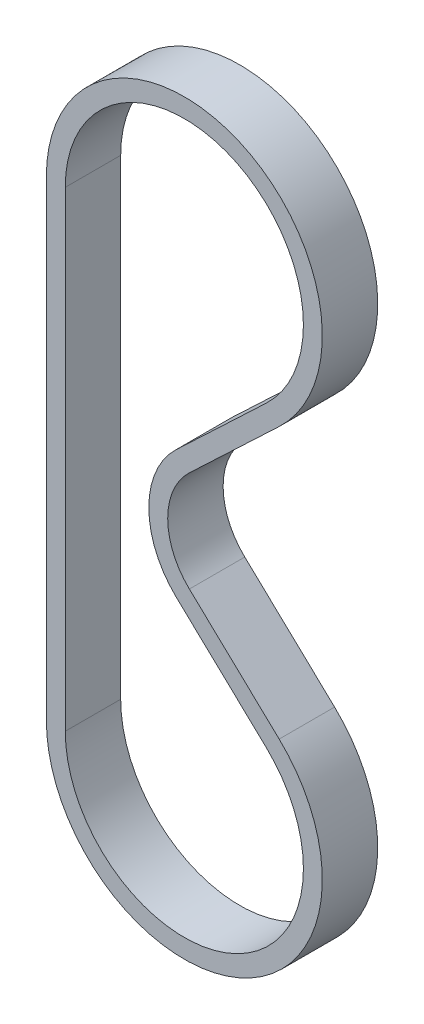
ISO-10303-21;
HEADER;
FILE_DESCRIPTION(('STEP AP214'),'2;1');
FILE_NAME('part.step','',(''),(''),'','','');
FILE_SCHEMA(('AUTOMOTIVE_DESIGN { 1 0 10303 214 1 1 1 1 }'));
ENDSEC;
DATA;
#1=APPLICATION_CONTEXT('core data for automotive mechanical design processes');
#2=APPLICATION_PROTOCOL_DEFINITION('international standard','automotive_design',2000,#1);
#3=PRODUCT_CONTEXT('',#1,'mechanical');
#4=PRODUCT('Part','Part','',(#3));
#5=PRODUCT_RELATED_PRODUCT_CATEGORY('part','',(#4));
#6=PRODUCT_DEFINITION_FORMATION('','',#4);
#7=PRODUCT_DEFINITION_CONTEXT('part definition',#1,'design');
#8=PRODUCT_DEFINITION('design','',#6,#7);
#9=PRODUCT_DEFINITION_SHAPE('','',#8);
#10=(LENGTH_UNIT() NAMED_UNIT(*) SI_UNIT(.MILLI.,.METRE.));
#11=(NAMED_UNIT(*) PLANE_ANGLE_UNIT() SI_UNIT($,.RADIAN.));
#12=(NAMED_UNIT(*) SI_UNIT($,.STERADIAN.) SOLID_ANGLE_UNIT());
#13=UNCERTAINTY_MEASURE_WITH_UNIT(LENGTH_MEASURE(1.E-05),#10,'distance_accuracy_value','');
#14=(GEOMETRIC_REPRESENTATION_CONTEXT(3) GLOBAL_UNCERTAINTY_ASSIGNED_CONTEXT((#13)) GLOBAL_UNIT_ASSIGNED_CONTEXT((#10,
#11,#12)) REPRESENTATION_CONTEXT('',''));
#15=CARTESIAN_POINT('',(0.,0.,0.));
#16=DIRECTION('',(0.,0.,1.));
#17=DIRECTION('',(1.,0.,0.));
#18=AXIS2_PLACEMENT_3D('',#15,#16,#17);
#19=CARTESIAN_POINT('',(0.,85.,10.));
#20=DIRECTION('',(0.,0.,-1.));
#21=DIRECTION('',(-1.,0.,0.));
#22=AXIS2_PLACEMENT_3D('',#19,#20,#21);
#23=PLANE('',#22);
#24=CARTESIAN_POINT('',(0.,85.,10.));
#25=DIRECTION('',(0.,0.,-1.));
#26=DIRECTION('',(-1.,0.,0.));
#27=AXIS2_PLACEMENT_3D('',#24,#25,#26);
#28=CIRCLE('',#27,24.895);
#29=CARTESIAN_POINT('',(17.1145721870697,66.9209390771097,10.));
#30=VERTEX_POINT('',#29);
#31=CARTESIAN_POINT('',(-24.895,85.,10.));
#32=VERTEX_POINT('',#31);
#33=EDGE_CURVE('E221',#30,#32,#28,.F.);
#34=ORIENTED_EDGE('',*,*,#33,.T.);
#35=DIRECTION('',(0.,-1.,0.));
#36=VECTOR('',#35,1.);
#37=CARTESIAN_POINT('',(-24.895,85.,10.));
#38=LINE('',#37,#36);
#39=CARTESIAN_POINT('',(-24.895,0.,10.));
#40=VERTEX_POINT('',#39);
#41=EDGE_CURVE('E224',#32,#40,#38,.T.);
#42=ORIENTED_EDGE('',*,*,#41,.T.);
#43=CARTESIAN_POINT('',(0.,0.,10.));
#44=DIRECTION('',(0.,0.,-1.));
#45=DIRECTION('',(-1.,0.,0.));
#46=AXIS2_PLACEMENT_3D('',#43,#44,#45);
#47=CIRCLE('',#46,24.895);
#48=CARTESIAN_POINT('',(17.1145721870697,18.0790609228903,10.));
#49=VERTEX_POINT('',#48);
#50=EDGE_CURVE('E227',#40,#49,#47,.F.);
#51=ORIENTED_EDGE('',*,*,#50,.T.);
#52=DIRECTION('',(-0.726212529539678,0.68747026258565,0.));
#53=VECTOR('',#52,1.);
#54=CARTESIAN_POINT('',(-25.3216368748589,58.2513666877548,10.));
#55=LINE('',#54,#53);
#56=CARTESIAN_POINT('',(0.906621717679384,33.422343380754,10.));
#57=VERTEX_POINT('',#56);
#58=EDGE_CURVE('E229',#49,#57,#55,.T.);
#59=ORIENTED_EDGE('',*,*,#58,.T.);
#60=CARTESIAN_POINT('',(9.50000000000001,42.5,10.));
#61=DIRECTION('',(0.,0.,-1.));
#62=DIRECTION('',(-1.,0.,0.));
#63=AXIS2_PLACEMENT_3D('',#60,#61,#62);
#64=CIRCLE('',#63,12.5);
#65=CARTESIAN_POINT('',(0.906621717679388,51.577656619246,10.));
#66=VERTEX_POINT('',#65);
#67=EDGE_CURVE('E231',#57,#66,#64,.T.);
#68=ORIENTED_EDGE('',*,*,#67,.T.);
#69=DIRECTION('',(0.726212529539678,0.68747026258565,0.));
#70=VECTOR('',#69,1.);
#71=CARTESIAN_POINT('',(17.1145721870697,66.9209390771097,10.));
#72=LINE('',#71,#70);
#73=EDGE_CURVE('E233',#66,#30,#72,.T.);
#74=ORIENTED_EDGE('',*,*,#73,.T.);
#75=EDGE_LOOP('',(#34,#42,#51,#59,#68,#74));
#76=FACE_BOUND('',#75,.T.);
#77=CARTESIAN_POINT('',(0.,85.,10.));
#78=DIRECTION('',(0.,0.,-1.));
#79=DIRECTION('',(-1.,0.,0.));
#80=AXIS2_PLACEMENT_3D('',#77,#78,#79);
#81=CIRCLE('',#80,21.485);
#82=CARTESIAN_POINT('',(14.7702985916527,69.39732380284,10.));
#83=VERTEX_POINT('',#82);
#84=CARTESIAN_POINT('',(-21.485,85.,10.));
#85=VERTEX_POINT('',#84);
#86=EDGE_CURVE('E170',#83,#85,#81,.F.);
#87=ORIENTED_EDGE('',*,*,#86,.F.);
#88=DIRECTION('',(0.726212529539678,0.68747026258565,0.));
#89=VECTOR('',#88,1.);
#90=CARTESIAN_POINT('',(14.7702985916527,69.39732380284,10.));
#91=LINE('',#90,#89);
#92=CARTESIAN_POINT('',(-1.43765187773768,54.0540413449763,10.));
#93=VERTEX_POINT('',#92);
#94=EDGE_CURVE('E199',#93,#83,#91,.T.);
#95=ORIENTED_EDGE('',*,*,#94,.F.);
#96=CARTESIAN_POINT('',(9.50000000000001,42.5,10.));
#97=DIRECTION('',(0.,0.,-1.));
#98=DIRECTION('',(-1.,0.,0.));
#99=AXIS2_PLACEMENT_3D('',#96,#97,#98);
#100=CIRCLE('',#99,15.91);
#101=CARTESIAN_POINT('',(-1.43765187773768,30.9459586550237,10.));
#102=VERTEX_POINT('',#101);
#103=EDGE_CURVE('E197',#102,#93,#100,.T.);
#104=ORIENTED_EDGE('',*,*,#103,.F.);
#105=DIRECTION('',(-0.726212529539678,0.68747026258565,0.));
#106=VECTOR('',#105,1.);
#107=CARTESIAN_POINT('',(-27.665910470276,55.7749819620245,10.));
#108=LINE('',#107,#106);
#109=CARTESIAN_POINT('',(14.7702985916527,15.60267619716,10.));
#110=VERTEX_POINT('',#109);
#111=EDGE_CURVE('E193',#110,#102,#108,.T.);
#112=ORIENTED_EDGE('',*,*,#111,.F.);
#113=CARTESIAN_POINT('',(0.,0.,10.));
#114=DIRECTION('',(0.,0.,-1.));
#115=DIRECTION('',(-1.,0.,0.));
#116=AXIS2_PLACEMENT_3D('',#113,#114,#115);
#117=CIRCLE('',#116,21.485);
#118=CARTESIAN_POINT('',(-21.485,0.,10.));
#119=VERTEX_POINT('',#118);
#120=EDGE_CURVE('E191',#119,#110,#117,.F.);
#121=ORIENTED_EDGE('',*,*,#120,.F.);
#122=DIRECTION('',(0.,-1.,0.));
#123=VECTOR('',#122,1.);
#124=CARTESIAN_POINT('',(-21.485,85.,10.));
#125=LINE('',#124,#123);
#126=EDGE_CURVE('E178',#85,#119,#125,.T.);
#127=ORIENTED_EDGE('',*,*,#126,.F.);
#128=EDGE_LOOP('',(#87,#95,#104,#112,#121,#127));
#129=FACE_BOUND('',#128,.T.);
#130=ADVANCED_FACE('F81',(#76,#129),#23,.F.);
#131=CARTESIAN_POINT('',(0.,85.,0.));
#132=DIRECTION('',(0.,0.,-1.));
#133=DIRECTION('',(-1.,0.,0.));
#134=AXIS2_PLACEMENT_3D('',#131,#132,#133);
#135=PLANE('',#134);
#136=CARTESIAN_POINT('',(0.,85.,0.));
#137=DIRECTION('',(0.,0.,-1.));
#138=DIRECTION('',(-1.,0.,0.));
#139=AXIS2_PLACEMENT_3D('',#136,#137,#138);
#140=CIRCLE('',#139,24.895);
#141=CARTESIAN_POINT('',(17.1145721870697,66.9209390771097,0.));
#142=VERTEX_POINT('',#141);
#143=CARTESIAN_POINT('',(-24.895,85.,0.));
#144=VERTEX_POINT('',#143);
#145=EDGE_CURVE('E186',#142,#144,#140,.F.);
#146=ORIENTED_EDGE('',*,*,#145,.F.);
#147=DIRECTION('',(0.726212529539678,0.68747026258565,0.));
#148=VECTOR('',#147,1.);
#149=CARTESIAN_POINT('',(17.1145721870697,66.9209390771097,0.));
#150=LINE('',#149,#148);
#151=CARTESIAN_POINT('',(0.906621717679388,51.577656619246,0.));
#152=VERTEX_POINT('',#151);
#153=EDGE_CURVE('E225',#152,#142,#150,.T.);
#154=ORIENTED_EDGE('',*,*,#153,.F.);
#155=CARTESIAN_POINT('',(9.50000000000001,42.5,0.));
#156=DIRECTION('',(0.,0.,-1.));
#157=DIRECTION('',(-1.,0.,0.));
#158=AXIS2_PLACEMENT_3D('',#155,#156,#157);
#159=CIRCLE('',#158,12.5);
#160=CARTESIAN_POINT('',(0.906621717679384,33.422343380754,0.));
#161=VERTEX_POINT('',#160);
#162=EDGE_CURVE('E244',#161,#152,#159,.T.);
#163=ORIENTED_EDGE('',*,*,#162,.F.);
#164=DIRECTION('',(-0.726212529539678,0.68747026258565,0.));
#165=VECTOR('',#164,1.);
#166=CARTESIAN_POINT('',(-25.3216368748589,58.2513666877548,0.));
#167=LINE('',#166,#165);
#168=CARTESIAN_POINT('',(17.1145721870697,18.0790609228903,0.));
#169=VERTEX_POINT('',#168);
#170=EDGE_CURVE('E242',#169,#161,#167,.T.);
#171=ORIENTED_EDGE('',*,*,#170,.F.);
#172=CARTESIAN_POINT('',(0.,0.,0.));
#173=DIRECTION('',(0.,0.,-1.));
#174=DIRECTION('',(-1.,0.,0.));
#175=AXIS2_PLACEMENT_3D('',#172,#173,#174);
#176=CIRCLE('',#175,24.895);
#177=CARTESIAN_POINT('',(-24.895,0.,0.));
#178=VERTEX_POINT('',#177);
#179=EDGE_CURVE('E240',#178,#169,#176,.F.);
#180=ORIENTED_EDGE('',*,*,#179,.F.);
#181=DIRECTION('',(0.,-1.,0.));
#182=VECTOR('',#181,1.);
#183=CARTESIAN_POINT('',(-24.895,85.,0.));
#184=LINE('',#183,#182);
#185=EDGE_CURVE('E238',#144,#178,#184,.T.);
#186=ORIENTED_EDGE('',*,*,#185,.F.);
#187=EDGE_LOOP('',(#146,#154,#163,#171,#180,#186));
#188=FACE_BOUND('',#187,.T.);
#189=DIRECTION('',(0.726212529539678,0.68747026258565,0.));
#190=VECTOR('',#189,1.);
#191=CARTESIAN_POINT('',(14.7702985916527,69.39732380284,0.));
#192=LINE('',#191,#190);
#193=CARTESIAN_POINT('',(-1.43765187773768,54.0540413449763,0.));
#194=VERTEX_POINT('',#193);
#195=CARTESIAN_POINT('',(14.7702985916527,69.39732380284,0.));
#196=VERTEX_POINT('',#195);
#197=EDGE_CURVE('E179',#194,#196,#192,.T.);
#198=ORIENTED_EDGE('',*,*,#197,.T.);
#199=CARTESIAN_POINT('',(0.,85.,0.));
#200=DIRECTION('',(0.,0.,-1.));
#201=DIRECTION('',(-1.,0.,0.));
#202=AXIS2_PLACEMENT_3D('',#199,#200,#201);
#203=CIRCLE('',#202,21.485);
#204=CARTESIAN_POINT('',(-21.485,85.,0.));
#205=VERTEX_POINT('',#204);
#206=EDGE_CURVE('E104',#196,#205,#203,.F.);
#207=ORIENTED_EDGE('',*,*,#206,.T.);
#208=DIRECTION('',(0.,-1.,0.));
#209=VECTOR('',#208,1.);
#210=CARTESIAN_POINT('',(-21.485,85.,0.));
#211=LINE('',#210,#209);
#212=CARTESIAN_POINT('',(-21.485,0.,0.));
#213=VERTEX_POINT('',#212);
#214=EDGE_CURVE('E185',#205,#213,#211,.T.);
#215=ORIENTED_EDGE('',*,*,#214,.T.);
#216=CARTESIAN_POINT('',(0.,0.,0.));
#217=DIRECTION('',(0.,0.,-1.));
#218=DIRECTION('',(-1.,0.,0.));
#219=AXIS2_PLACEMENT_3D('',#216,#217,#218);
#220=CIRCLE('',#219,21.485);
#221=CARTESIAN_POINT('',(14.7702985916527,15.60267619716,0.));
#222=VERTEX_POINT('',#221);
#223=EDGE_CURVE('E203',#213,#222,#220,.F.);
#224=ORIENTED_EDGE('',*,*,#223,.T.);
#225=DIRECTION('',(-0.726212529539678,0.68747026258565,0.));
#226=VECTOR('',#225,1.);
#227=CARTESIAN_POINT('',(-27.665910470276,55.7749819620245,0.));
#228=LINE('',#227,#226);
#229=CARTESIAN_POINT('',(-1.43765187773768,30.9459586550237,0.));
#230=VERTEX_POINT('',#229);
#231=EDGE_CURVE('E206',#222,#230,#228,.T.);
#232=ORIENTED_EDGE('',*,*,#231,.T.);
#233=CARTESIAN_POINT('',(9.50000000000001,42.5,0.));
#234=DIRECTION('',(0.,0.,-1.));
#235=DIRECTION('',(-1.,0.,0.));
#236=AXIS2_PLACEMENT_3D('',#233,#234,#235);
#237=CIRCLE('',#236,15.91);
#238=EDGE_CURVE('E209',#230,#194,#237,.T.);
#239=ORIENTED_EDGE('',*,*,#238,.T.);
#240=EDGE_LOOP('',(#198,#207,#215,#224,#232,#239));
#241=FACE_BOUND('',#240,.T.);
#242=ADVANCED_FACE('F268',(#188,#241),#135,.T.);
#243=CARTESIAN_POINT('',(0.,85.,10.));
#244=DIRECTION('',(0.,0.,-1.));
#245=DIRECTION('',(-1.,0.,0.));
#246=AXIS2_PLACEMENT_3D('',#243,#244,#245);
#247=CYLINDRICAL_SURFACE('',#246,24.895);
#248=ORIENTED_EDGE('',*,*,#145,.T.);
#249=DIRECTION('',(0.,0.,-1.));
#250=VECTOR('',#249,1.);
#251=CARTESIAN_POINT('',(-24.895,85.,10.));
#252=LINE('',#251,#250);
#253=EDGE_CURVE('E12',#32,#144,#252,.T.);
#254=ORIENTED_EDGE('',*,*,#253,.F.);
#255=ORIENTED_EDGE('',*,*,#33,.F.);
#256=DIRECTION('',(0.,0.,-1.));
#257=VECTOR('',#256,1.);
#258=CARTESIAN_POINT('',(17.1145721870697,66.9209390771097,10.));
#259=LINE('',#258,#257);
#260=EDGE_CURVE('E235',#30,#142,#259,.T.);
#261=ORIENTED_EDGE('',*,*,#260,.T.);
#262=EDGE_LOOP('',(#248,#254,#255,#261));
#263=FACE_BOUND('',#262,.T.);
#264=ADVANCED_FACE('F83',(#263),#247,.T.);
#265=CARTESIAN_POINT('',(-24.895,85.,10.));
#266=DIRECTION('',(1.,0.,0.));
#267=DIRECTION('',(0.,0.,-1.));
#268=AXIS2_PLACEMENT_3D('',#265,#266,#267);
#269=PLANE('',#268);
#270=ORIENTED_EDGE('',*,*,#185,.T.);
#271=DIRECTION('',(0.,0.,-1.));
#272=VECTOR('',#271,1.);
#273=CARTESIAN_POINT('',(-24.895,0.,10.));
#274=LINE('',#273,#272);
#275=EDGE_CURVE('E89',#40,#178,#274,.T.);
#276=ORIENTED_EDGE('',*,*,#275,.F.);
#277=ORIENTED_EDGE('',*,*,#41,.F.);
#278=ORIENTED_EDGE('',*,*,#253,.T.);
#279=EDGE_LOOP('',(#270,#276,#277,#278));
#280=FACE_BOUND('',#279,.T.);
#281=ADVANCED_FACE('F285',(#280),#269,.F.);
#282=CARTESIAN_POINT('',(0.,0.,10.));
#283=DIRECTION('',(0.,0.,-1.));
#284=DIRECTION('',(-1.,0.,0.));
#285=AXIS2_PLACEMENT_3D('',#282,#283,#284);
#286=CYLINDRICAL_SURFACE('',#285,24.895);
#287=ORIENTED_EDGE('',*,*,#179,.T.);
#288=DIRECTION('',(0.,0.,-1.));
#289=VECTOR('',#288,1.);
#290=CARTESIAN_POINT('',(17.1145721870697,18.0790609228903,10.));
#291=LINE('',#290,#289);
#292=EDGE_CURVE('E255',#49,#169,#291,.T.);
#293=ORIENTED_EDGE('',*,*,#292,.F.);
#294=ORIENTED_EDGE('',*,*,#50,.F.);
#295=ORIENTED_EDGE('',*,*,#275,.T.);
#296=EDGE_LOOP('',(#287,#293,#294,#295));
#297=FACE_BOUND('',#296,.T.);
#298=ADVANCED_FACE('F262',(#297),#286,.T.);
#299=CARTESIAN_POINT('',(-25.3216368748589,58.2513666877548,10.));
#300=DIRECTION('',(-0.68747026258565,-0.726212529539678,0.));
#301=DIRECTION('',(0.726212529539678,-0.68747026258565,0.));
#302=AXIS2_PLACEMENT_3D('',#299,#300,#301);
#303=PLANE('',#302);
#304=ORIENTED_EDGE('',*,*,#170,.T.);
#305=DIRECTION('',(0.,0.,-1.));
#306=VECTOR('',#305,1.);
#307=CARTESIAN_POINT('',(0.906621717679384,33.422343380754,10.));
#308=LINE('',#307,#306);
#309=EDGE_CURVE('E252',#57,#161,#308,.T.);
#310=ORIENTED_EDGE('',*,*,#309,.F.);
#311=ORIENTED_EDGE('',*,*,#58,.F.);
#312=ORIENTED_EDGE('',*,*,#292,.T.);
#313=EDGE_LOOP('',(#304,#310,#311,#312));
#314=FACE_BOUND('',#313,.T.);
#315=ADVANCED_FACE('F274',(#314),#303,.F.);
#316=CARTESIAN_POINT('',(9.50000000000001,42.5,10.));
#317=DIRECTION('',(0.,0.,-1.));
#318=DIRECTION('',(-1.,0.,0.));
#319=AXIS2_PLACEMENT_3D('',#316,#317,#318);
#320=CYLINDRICAL_SURFACE('',#319,12.5);
#321=ORIENTED_EDGE('',*,*,#162,.T.);
#322=DIRECTION('',(0.,0.,-1.));
#323=VECTOR('',#322,1.);
#324=CARTESIAN_POINT('',(0.906621717679388,51.577656619246,10.));
#325=LINE('',#324,#323);
#326=EDGE_CURVE('E249',#66,#152,#325,.T.);
#327=ORIENTED_EDGE('',*,*,#326,.F.);
#328=ORIENTED_EDGE('',*,*,#67,.F.);
#329=ORIENTED_EDGE('',*,*,#309,.T.);
#330=EDGE_LOOP('',(#321,#327,#328,#329));
#331=FACE_BOUND('',#330,.T.);
#332=ADVANCED_FACE('F278',(#331),#320,.F.);
#333=CARTESIAN_POINT('',(17.1145721870697,66.9209390771097,10.));
#334=DIRECTION('',(-0.68747026258565,0.726212529539678,0.));
#335=DIRECTION('',(-0.726212529539678,-0.68747026258565,0.));
#336=AXIS2_PLACEMENT_3D('',#333,#334,#335);
#337=PLANE('',#336);
#338=ORIENTED_EDGE('',*,*,#153,.T.);
#339=ORIENTED_EDGE('',*,*,#260,.F.);
#340=ORIENTED_EDGE('',*,*,#73,.F.);
#341=ORIENTED_EDGE('',*,*,#326,.T.);
#342=EDGE_LOOP('',(#338,#339,#340,#341));
#343=FACE_BOUND('',#342,.T.);
#344=ADVANCED_FACE('F288',(#343),#337,.F.);
#345=CARTESIAN_POINT('',(0.,85.,10.));
#346=DIRECTION('',(0.,0.,-1.));
#347=DIRECTION('',(-1.,0.,0.));
#348=AXIS2_PLACEMENT_3D('',#345,#346,#347);
#349=CYLINDRICAL_SURFACE('',#348,21.485);
#350=ORIENTED_EDGE('',*,*,#206,.F.);
#351=DIRECTION('',(0.,0.,-1.));
#352=VECTOR('',#351,1.);
#353=CARTESIAN_POINT('',(14.7702985916527,69.39732380284,10.));
#354=LINE('',#353,#352);
#355=EDGE_CURVE('E174',#83,#196,#354,.T.);
#356=ORIENTED_EDGE('',*,*,#355,.F.);
#357=ORIENTED_EDGE('',*,*,#86,.T.);
#358=DIRECTION('',(0.,0.,-1.));
#359=VECTOR('',#358,1.);
#360=CARTESIAN_POINT('',(-21.485,85.,10.));
#361=LINE('',#360,#359);
#362=EDGE_CURVE('E173',#85,#205,#361,.T.);
#363=ORIENTED_EDGE('',*,*,#362,.T.);
#364=EDGE_LOOP('',(#350,#356,#357,#363));
#365=FACE_BOUND('',#364,.T.);
#366=ADVANCED_FACE('F172',(#365),#349,.F.);
#367=CARTESIAN_POINT('',(-21.485,85.,10.));
#368=DIRECTION('',(1.,0.,0.));
#369=DIRECTION('',(0.,0.,-1.));
#370=AXIS2_PLACEMENT_3D('',#367,#368,#369);
#371=PLANE('',#370);
#372=ORIENTED_EDGE('',*,*,#214,.F.);
#373=ORIENTED_EDGE('',*,*,#362,.F.);
#374=ORIENTED_EDGE('',*,*,#126,.T.);
#375=DIRECTION('',(0.,0.,-1.));
#376=VECTOR('',#375,1.);
#377=CARTESIAN_POINT('',(-21.485,0.,10.));
#378=LINE('',#377,#376);
#379=EDGE_CURVE('E187',#119,#213,#378,.T.);
#380=ORIENTED_EDGE('',*,*,#379,.T.);
#381=EDGE_LOOP('',(#372,#373,#374,#380));
#382=FACE_BOUND('',#381,.T.);
#383=ADVANCED_FACE('F182',(#382),#371,.T.);
#384=CARTESIAN_POINT('',(0.,0.,10.));
#385=DIRECTION('',(0.,0.,-1.));
#386=DIRECTION('',(-1.,0.,0.));
#387=AXIS2_PLACEMENT_3D('',#384,#385,#386);
#388=CYLINDRICAL_SURFACE('',#387,21.485);
#389=ORIENTED_EDGE('',*,*,#223,.F.);
#390=ORIENTED_EDGE('',*,*,#379,.F.);
#391=ORIENTED_EDGE('',*,*,#120,.T.);
#392=DIRECTION('',(0.,0.,-1.));
#393=VECTOR('',#392,1.);
#394=CARTESIAN_POINT('',(14.7702985916527,15.60267619716,10.));
#395=LINE('',#394,#393);
#396=EDGE_CURVE('E218',#110,#222,#395,.T.);
#397=ORIENTED_EDGE('',*,*,#396,.T.);
#398=EDGE_LOOP('',(#389,#390,#391,#397));
#399=FACE_BOUND('',#398,.T.);
#400=ADVANCED_FACE('F306',(#399),#388,.F.);
#401=CARTESIAN_POINT('',(-27.665910470276,55.7749819620245,10.));
#402=DIRECTION('',(-0.68747026258565,-0.726212529539678,0.));
#403=DIRECTION('',(0.726212529539678,-0.68747026258565,0.));
#404=AXIS2_PLACEMENT_3D('',#401,#402,#403);
#405=PLANE('',#404);
#406=ORIENTED_EDGE('',*,*,#231,.F.);
#407=ORIENTED_EDGE('',*,*,#396,.F.);
#408=ORIENTED_EDGE('',*,*,#111,.T.);
#409=DIRECTION('',(0.,0.,-1.));
#410=VECTOR('',#409,1.);
#411=CARTESIAN_POINT('',(-1.43765187773768,30.9459586550237,10.));
#412=LINE('',#411,#410);
#413=EDGE_CURVE('E216',#102,#230,#412,.T.);
#414=ORIENTED_EDGE('',*,*,#413,.T.);
#415=EDGE_LOOP('',(#406,#407,#408,#414));
#416=FACE_BOUND('',#415,.T.);
#417=ADVANCED_FACE('F309',(#416),#405,.T.);
#418=CARTESIAN_POINT('',(9.50000000000001,42.5,10.));
#419=DIRECTION('',(0.,0.,-1.));
#420=DIRECTION('',(-1.,0.,0.));
#421=AXIS2_PLACEMENT_3D('',#418,#419,#420);
#422=CYLINDRICAL_SURFACE('',#421,15.91);
#423=ORIENTED_EDGE('',*,*,#238,.F.);
#424=ORIENTED_EDGE('',*,*,#413,.F.);
#425=ORIENTED_EDGE('',*,*,#103,.T.);
#426=DIRECTION('',(0.,0.,-1.));
#427=VECTOR('',#426,1.);
#428=CARTESIAN_POINT('',(-1.43765187773768,54.0540413449763,10.));
#429=LINE('',#428,#427);
#430=EDGE_CURVE('E96',#93,#194,#429,.T.);
#431=ORIENTED_EDGE('',*,*,#430,.T.);
#432=EDGE_LOOP('',(#423,#424,#425,#431));
#433=FACE_BOUND('',#432,.T.);
#434=ADVANCED_FACE('F313',(#433),#422,.T.);
#435=CARTESIAN_POINT('',(14.7702985916527,69.39732380284,10.));
#436=DIRECTION('',(-0.68747026258565,0.726212529539678,0.));
#437=DIRECTION('',(-0.726212529539678,-0.68747026258565,0.));
#438=AXIS2_PLACEMENT_3D('',#435,#436,#437);
#439=PLANE('',#438);
#440=ORIENTED_EDGE('',*,*,#197,.F.);
#441=ORIENTED_EDGE('',*,*,#430,.F.);
#442=ORIENTED_EDGE('',*,*,#94,.T.);
#443=ORIENTED_EDGE('',*,*,#355,.T.);
#444=EDGE_LOOP('',(#440,#441,#442,#443));
#445=FACE_BOUND('',#444,.T.);
#446=ADVANCED_FACE('F317',(#445),#439,.T.);
#447=CLOSED_SHELL('',(#130,#242,#264,#281,#298,#315,#332,#344,#366,#383,#400,#417,#434,#446));
#448=MANIFOLD_SOLID_BREP('B2',#447);
#449=ADVANCED_BREP_SHAPE_REPRESENTATION('',(#18,#448),#14);
#450=SHAPE_DEFINITION_REPRESENTATION(#9,#449);
ENDSEC;
END-ISO-10303-21;
